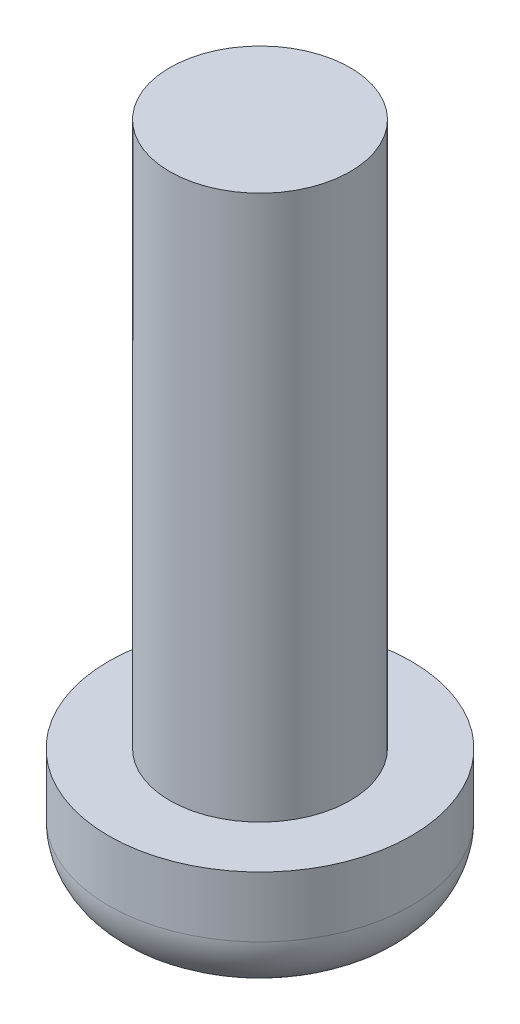
ISO-10303-21;
HEADER;
FILE_DESCRIPTION(('STEP AP214'),'2;1');
FILE_NAME('part.step','',(''),(''),'','','');
FILE_SCHEMA(('AUTOMOTIVE_DESIGN { 1 0 10303 214 1 1 1 1 }'));
ENDSEC;
DATA;
#1=APPLICATION_CONTEXT('core data for automotive mechanical design processes');
#2=APPLICATION_PROTOCOL_DEFINITION('international standard','automotive_design',2000,#1);
#3=PRODUCT_CONTEXT('',#1,'mechanical');
#4=PRODUCT('Part','Part','',(#3));
#5=PRODUCT_RELATED_PRODUCT_CATEGORY('part','',(#4));
#6=PRODUCT_DEFINITION_FORMATION('','',#4);
#7=PRODUCT_DEFINITION_CONTEXT('part definition',#1,'design');
#8=PRODUCT_DEFINITION('design','',#6,#7);
#9=PRODUCT_DEFINITION_SHAPE('','',#8);
#10=(LENGTH_UNIT() NAMED_UNIT(*) SI_UNIT(.MILLI.,.METRE.));
#11=(NAMED_UNIT(*) PLANE_ANGLE_UNIT() SI_UNIT($,.RADIAN.));
#12=(NAMED_UNIT(*) SI_UNIT($,.STERADIAN.) SOLID_ANGLE_UNIT());
#13=UNCERTAINTY_MEASURE_WITH_UNIT(LENGTH_MEASURE(1.E-05),#10,'distance_accuracy_value','');
#14=(GEOMETRIC_REPRESENTATION_CONTEXT(3) GLOBAL_UNCERTAINTY_ASSIGNED_CONTEXT((#13)) GLOBAL_UNIT_ASSIGNED_CONTEXT((#10,
#11,#12)) REPRESENTATION_CONTEXT('',''));
#15=CARTESIAN_POINT('',(0.,0.,0.));
#16=DIRECTION('',(0.,0.,1.));
#17=DIRECTION('',(1.,0.,0.));
#18=AXIS2_PLACEMENT_3D('',#15,#16,#17);
#19=CARTESIAN_POINT('',(0.,2.,0.));
#20=DIRECTION('',(0.,-1.,0.));
#21=DIRECTION('',(0.,0.,-1.));
#22=AXIS2_PLACEMENT_3D('',#19,#20,#21);
#23=CYLINDRICAL_SURFACE('',#22,2.5);
#24=CARTESIAN_POINT('',(0.,1.,0.));
#25=DIRECTION('',(0.,1.,0.));
#26=DIRECTION('',(0.,0.,1.));
#27=AXIS2_PLACEMENT_3D('',#24,#25,#26);
#28=CIRCLE('',#27,2.5);
#29=CARTESIAN_POINT('',(0.,1.,2.5));
#30=VERTEX_POINT('',#29);
#31=EDGE_CURVE('E37',#30,#30,#28,.T.);
#32=ORIENTED_EDGE('',*,*,#31,.T.);
#33=EDGE_LOOP('',(#32));
#34=FACE_BOUND('',#33,.T.);
#35=CARTESIAN_POINT('',(0.,2.,0.));
#36=DIRECTION('',(0.,1.,0.));
#37=DIRECTION('',(0.,0.,1.));
#38=AXIS2_PLACEMENT_3D('',#35,#36,#37);
#39=CIRCLE('',#38,2.5);
#40=CARTESIAN_POINT('',(0.,2.,2.5));
#41=VERTEX_POINT('',#40);
#42=EDGE_CURVE('E45',#41,#41,#39,.T.);
#43=ORIENTED_EDGE('',*,*,#42,.F.);
#44=EDGE_LOOP('',(#43));
#45=FACE_BOUND('',#44,.T.);
#46=ADVANCED_FACE('F30',(#34,#45),#23,.T.);
#47=CARTESIAN_POINT('',(0.,2.,0.));
#48=DIRECTION('',(0.,1.,0.));
#49=DIRECTION('',(0.,0.,1.));
#50=AXIS2_PLACEMENT_3D('',#47,#48,#49);
#51=PLANE('',#50);
#52=CARTESIAN_POINT('',(0.,2.,0.));
#53=DIRECTION('',(0.,1.,0.));
#54=DIRECTION('',(0.,0.,1.));
#55=AXIS2_PLACEMENT_3D('',#52,#53,#54);
#56=CIRCLE('',#55,1.49);
#57=CARTESIAN_POINT('',(0.,2.,1.49));
#58=VERTEX_POINT('',#57);
#59=EDGE_CURVE('E41',#58,#58,#56,.T.);
#60=ORIENTED_EDGE('',*,*,#59,.F.);
#61=EDGE_LOOP('',(#60));
#62=FACE_BOUND('',#61,.T.);
#63=ORIENTED_EDGE('',*,*,#42,.T.);
#64=EDGE_LOOP('',(#63));
#65=FACE_BOUND('',#64,.T.);
#66=ADVANCED_FACE('F63',(#62,#65),#51,.T.);
#67=CARTESIAN_POINT('',(0.,0.,0.));
#68=DIRECTION('',(0.,1.,0.));
#69=DIRECTION('',(0.,0.,1.));
#70=AXIS2_PLACEMENT_3D('',#67,#68,#69);
#71=PLANE('',#70);
#72=CARTESIAN_POINT('',(0.,0.,0.));
#73=DIRECTION('',(0.,1.,0.));
#74=DIRECTION('',(0.,0.,1.));
#75=AXIS2_PLACEMENT_3D('',#72,#73,#74);
#76=CIRCLE('',#75,1.5);
#77=CARTESIAN_POINT('',(0.,0.,1.5));
#78=VERTEX_POINT('',#77);
#79=EDGE_CURVE('E10',#78,#78,#76,.F.);
#80=ORIENTED_EDGE('',*,*,#79,.T.);
#81=EDGE_LOOP('',(#80));
#82=FACE_BOUND('',#81,.T.);
#83=ADVANCED_FACE('F59',(#82),#71,.F.);
#84=CARTESIAN_POINT('',(0.,11.,0.));
#85=DIRECTION('',(0.,-1.,0.));
#86=DIRECTION('',(0.,0.,-1.));
#87=AXIS2_PLACEMENT_3D('',#84,#85,#86);
#88=CYLINDRICAL_SURFACE('',#87,1.49);
#89=CARTESIAN_POINT('',(0.,11.,0.));
#90=DIRECTION('',(0.,1.,0.));
#91=DIRECTION('',(0.,0.,1.));
#92=AXIS2_PLACEMENT_3D('',#89,#90,#91);
#93=CIRCLE('',#92,1.49);
#94=CARTESIAN_POINT('',(0.,11.,1.49));
#95=VERTEX_POINT('',#94);
#96=EDGE_CURVE('E49',#95,#95,#93,.T.);
#97=ORIENTED_EDGE('',*,*,#96,.F.);
#98=EDGE_LOOP('',(#97));
#99=FACE_BOUND('',#98,.T.);
#100=ORIENTED_EDGE('',*,*,#59,.T.);
#101=EDGE_LOOP('',(#100));
#102=FACE_BOUND('',#101,.T.);
#103=ADVANCED_FACE('F56',(#99,#102),#88,.T.);
#104=CARTESIAN_POINT('',(0.,11.,0.));
#105=DIRECTION('',(0.,1.,0.));
#106=DIRECTION('',(0.,0.,1.));
#107=AXIS2_PLACEMENT_3D('',#104,#105,#106);
#108=PLANE('',#107);
#109=ORIENTED_EDGE('',*,*,#96,.T.);
#110=EDGE_LOOP('',(#109));
#111=FACE_BOUND('',#110,.T.);
#112=ADVANCED_FACE('F54',(#111),#108,.T.);
#113=CARTESIAN_POINT('',(0.,1.,0.));
#114=DIRECTION('',(0.,1.,0.));
#115=DIRECTION('',(0.,0.,1.));
#116=AXIS2_PLACEMENT_3D('',#113,#114,#115);
#117=TOROIDAL_SURFACE('',#116,1.5,1.);
#118=ORIENTED_EDGE('',*,*,#79,.F.);
#119=EDGE_LOOP('',(#118));
#120=FACE_BOUND('',#119,.T.);
#121=ORIENTED_EDGE('',*,*,#31,.F.);
#122=EDGE_LOOP('',(#121));
#123=FACE_BOUND('',#122,.T.);
#124=ADVANCED_FACE('F32',(#120,#123),#117,.T.);
#125=CLOSED_SHELL('',(#46,#66,#83,#103,#112,#124));
#126=MANIFOLD_SOLID_BREP('B2',#125);
#127=ADVANCED_BREP_SHAPE_REPRESENTATION('',(#18,#126),#14);
#128=SHAPE_DEFINITION_REPRESENTATION(#9,#127);
ENDSEC;
END-ISO-10303-21;
